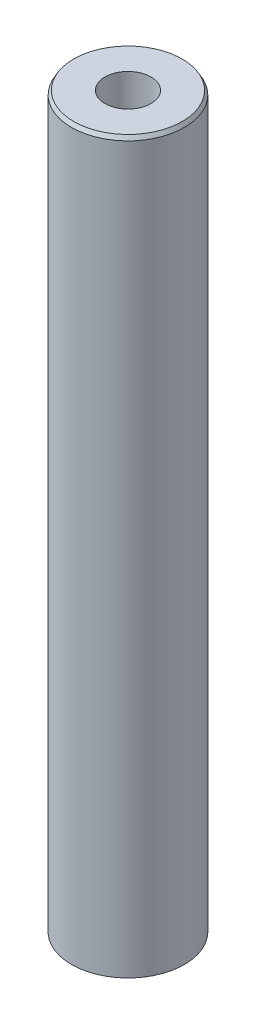
ISO-10303-21;
HEADER;
FILE_DESCRIPTION(('STEP AP214'),'2;1');
FILE_NAME('part.step','',(''),(''),'','','');
FILE_SCHEMA(('AUTOMOTIVE_DESIGN { 1 0 10303 214 1 1 1 1 }'));
ENDSEC;
DATA;
#1=APPLICATION_CONTEXT('core data for automotive mechanical design processes');
#2=APPLICATION_PROTOCOL_DEFINITION('international standard','automotive_design',2000,#1);
#3=PRODUCT_CONTEXT('',#1,'mechanical');
#4=PRODUCT('Part','Part','',(#3));
#5=PRODUCT_RELATED_PRODUCT_CATEGORY('part','',(#4));
#6=PRODUCT_DEFINITION_FORMATION('','',#4);
#7=PRODUCT_DEFINITION_CONTEXT('part definition',#1,'design');
#8=PRODUCT_DEFINITION('design','',#6,#7);
#9=PRODUCT_DEFINITION_SHAPE('','',#8);
#10=(LENGTH_UNIT() NAMED_UNIT(*) SI_UNIT(.MILLI.,.METRE.));
#11=(NAMED_UNIT(*) PLANE_ANGLE_UNIT() SI_UNIT($,.RADIAN.));
#12=(NAMED_UNIT(*) SI_UNIT($,.STERADIAN.) SOLID_ANGLE_UNIT());
#13=UNCERTAINTY_MEASURE_WITH_UNIT(LENGTH_MEASURE(1.E-05),#10,'distance_accuracy_value','');
#14=(GEOMETRIC_REPRESENTATION_CONTEXT(3) GLOBAL_UNCERTAINTY_ASSIGNED_CONTEXT((#13)) GLOBAL_UNIT_ASSIGNED_CONTEXT((#10,
#11,#12)) REPRESENTATION_CONTEXT('',''));
#15=CARTESIAN_POINT('',(0.,0.,0.));
#16=DIRECTION('',(0.,0.,1.));
#17=DIRECTION('',(1.,0.,0.));
#18=AXIS2_PLACEMENT_3D('',#15,#16,#17);
#19=CARTESIAN_POINT('',(0.,129.464974264316,0.));
#20=DIRECTION('',(0.,-1.,0.));
#21=DIRECTION('',(0.,0.,-1.));
#22=AXIS2_PLACEMENT_3D('',#19,#20,#21);
#23=CYLINDRICAL_SURFACE('',#22,10.);
#24=CARTESIAN_POINT('',(0.,128.767709341466,0.));
#25=DIRECTION('',(0.,1.,0.));
#26=DIRECTION('',(0.,0.,1.));
#27=AXIS2_PLACEMENT_3D('',#24,#25,#26);
#28=CIRCLE('',#27,10.);
#29=CARTESIAN_POINT('',(0.,128.767709341466,10.));
#30=VERTEX_POINT('',#29);
#31=EDGE_CURVE('E50',#30,#30,#28,.F.);
#32=ORIENTED_EDGE('',*,*,#31,.T.);
#33=EDGE_LOOP('',(#32));
#34=FACE_BOUND('',#33,.T.);
#35=CARTESIAN_POINT('',(0.,0.402566090903445,0.));
#36=DIRECTION('',(0.,1.,0.));
#37=DIRECTION('',(0.,0.,1.));
#38=AXIS2_PLACEMENT_3D('',#35,#36,#37);
#39=CIRCLE('',#38,10.);
#40=CARTESIAN_POINT('',(0.,0.402566090903445,10.));
#41=VERTEX_POINT('',#40);
#42=EDGE_CURVE('E51',#41,#41,#39,.T.);
#43=ORIENTED_EDGE('',*,*,#42,.T.);
#44=EDGE_LOOP('',(#43));
#45=FACE_BOUND('',#44,.T.);
#46=ADVANCED_FACE('F39',(#34,#45),#23,.T.);
#47=CARTESIAN_POINT('',(0.,129.464974264316,0.));
#48=DIRECTION('',(0.,1.,0.));
#49=DIRECTION('',(0.,0.,1.));
#50=AXIS2_PLACEMENT_3D('',#47,#48,#49);
#51=PLANE('',#50);
#52=CARTESIAN_POINT('',(0.,129.464974264316,0.));
#53=DIRECTION('',(0.,1.,0.));
#54=DIRECTION('',(0.,0.,1.));
#55=AXIS2_PLACEMENT_3D('',#52,#53,#54);
#56=CIRCLE('',#55,9.59743390909654);
#57=CARTESIAN_POINT('',(0.,129.464974264316,9.59743390909654));
#58=VERTEX_POINT('',#57);
#59=EDGE_CURVE('E54',#58,#58,#56,.T.);
#60=ORIENTED_EDGE('',*,*,#59,.T.);
#61=EDGE_LOOP('',(#60));
#62=FACE_BOUND('',#61,.T.);
#63=CARTESIAN_POINT('',(0.,129.464974264316,0.));
#64=DIRECTION('',(0.,1.,0.));
#65=DIRECTION('',(0.,0.,1.));
#66=AXIS2_PLACEMENT_3D('',#63,#64,#65);
#67=CIRCLE('',#66,4.08217340599335);
#68=CARTESIAN_POINT('',(0.,129.464974264316,4.08217340599335));
#69=VERTEX_POINT('',#68);
#70=EDGE_CURVE('E58',#69,#69,#67,.T.);
#71=ORIENTED_EDGE('',*,*,#70,.F.);
#72=EDGE_LOOP('',(#71));
#73=FACE_BOUND('',#72,.T.);
#74=ADVANCED_FACE('F69',(#62,#73),#51,.T.);
#75=CARTESIAN_POINT('',(0.,0.,0.));
#76=DIRECTION('',(0.,1.,0.));
#77=DIRECTION('',(0.,0.,1.));
#78=AXIS2_PLACEMENT_3D('',#75,#76,#77);
#79=PLANE('',#78);
#80=CARTESIAN_POINT('',(0.,0.,0.));
#81=DIRECTION('',(0.,1.,0.));
#82=DIRECTION('',(0.,0.,1.));
#83=AXIS2_PLACEMENT_3D('',#80,#81,#82);
#84=CIRCLE('',#83,9.30273507715085);
#85=CARTESIAN_POINT('',(0.,0.,9.30273507715085));
#86=VERTEX_POINT('',#85);
#87=EDGE_CURVE('E10',#86,#86,#84,.F.);
#88=ORIENTED_EDGE('',*,*,#87,.T.);
#89=EDGE_LOOP('',(#88));
#90=FACE_BOUND('',#89,.T.);
#91=CARTESIAN_POINT('',(0.,0.,0.));
#92=DIRECTION('',(0.,1.,0.));
#93=DIRECTION('',(0.,0.,1.));
#94=AXIS2_PLACEMENT_3D('',#91,#92,#93);
#95=CIRCLE('',#94,4.08217340599335);
#96=CARTESIAN_POINT('',(0.,0.,4.08217340599335));
#97=VERTEX_POINT('',#96);
#98=EDGE_CURVE('E63',#97,#97,#95,.T.);
#99=ORIENTED_EDGE('',*,*,#98,.T.);
#100=EDGE_LOOP('',(#99));
#101=FACE_BOUND('',#100,.T.);
#102=ADVANCED_FACE('F75',(#90,#101),#79,.F.);
#103=CARTESIAN_POINT('',(0.,129.464974264316,0.));
#104=DIRECTION('',(0.,-1.,0.));
#105=DIRECTION('',(0.,0.,-1.));
#106=AXIS2_PLACEMENT_3D('',#103,#104,#105);
#107=CYLINDRICAL_SURFACE('',#106,4.08217340599335);
#108=ORIENTED_EDGE('',*,*,#70,.T.);
#109=EDGE_LOOP('',(#108));
#110=FACE_BOUND('',#109,.T.);
#111=ORIENTED_EDGE('',*,*,#98,.F.);
#112=EDGE_LOOP('',(#111));
#113=FACE_BOUND('',#112,.T.);
#114=ADVANCED_FACE('F70',(#110,#113),#107,.F.);
#115=CARTESIAN_POINT('',(0.,129.464974264316,0.));
#116=DIRECTION('',(0.,-1.,0.));
#117=DIRECTION('',(0.,0.,-1.));
#118=AXIS2_PLACEMENT_3D('',#115,#116,#117);
#119=CONICAL_SURFACE('',#118,9.59743390909654,0.5235987755983);
#120=ORIENTED_EDGE('',*,*,#31,.F.);
#121=EDGE_LOOP('',(#120));
#122=FACE_BOUND('',#121,.T.);
#123=ORIENTED_EDGE('',*,*,#59,.F.);
#124=EDGE_LOOP('',(#123));
#125=FACE_BOUND('',#124,.T.);
#126=ADVANCED_FACE('F81',(#122,#125),#119,.T.);
#127=CARTESIAN_POINT('',(0.,0.402566090903445,0.));
#128=DIRECTION('',(0.,1.,0.));
#129=DIRECTION('',(0.,0.,1.));
#130=AXIS2_PLACEMENT_3D('',#127,#128,#129);
#131=CONICAL_SURFACE('',#130,10.,1.04719755119659);
#132=ORIENTED_EDGE('',*,*,#87,.F.);
#133=EDGE_LOOP('',(#132));
#134=FACE_BOUND('',#133,.T.);
#135=ORIENTED_EDGE('',*,*,#42,.F.);
#136=EDGE_LOOP('',(#135));
#137=FACE_BOUND('',#136,.T.);
#138=ADVANCED_FACE('F45',(#134,#137),#131,.T.);
#139=CLOSED_SHELL('',(#46,#74,#102,#114,#126,#138));
#140=MANIFOLD_SOLID_BREP('B2',#139);
#141=ADVANCED_BREP_SHAPE_REPRESENTATION('',(#18,#140),#14);
#142=SHAPE_DEFINITION_REPRESENTATION(#9,#141);
ENDSEC;
END-ISO-10303-21;
